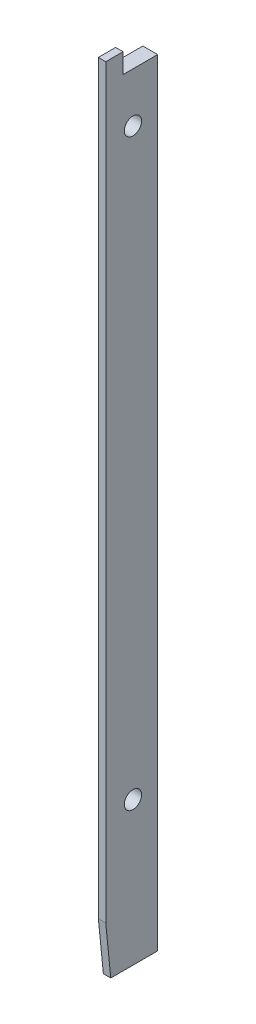
ISO-10303-21;
HEADER;
FILE_DESCRIPTION(('STEP AP214'),'2;1');
FILE_NAME('part.step','',(''),(''),'','','');
FILE_SCHEMA(('AUTOMOTIVE_DESIGN { 1 0 10303 214 1 1 1 1 }'));
ENDSEC;
DATA;
#1=APPLICATION_CONTEXT('core data for automotive mechanical design processes');
#2=APPLICATION_PROTOCOL_DEFINITION('international standard','automotive_design',2000,#1);
#3=PRODUCT_CONTEXT('',#1,'mechanical');
#4=PRODUCT('Part','Part','',(#3));
#5=PRODUCT_RELATED_PRODUCT_CATEGORY('part','',(#4));
#6=PRODUCT_DEFINITION_FORMATION('','',#4);
#7=PRODUCT_DEFINITION_CONTEXT('part definition',#1,'design');
#8=PRODUCT_DEFINITION('design','',#6,#7);
#9=PRODUCT_DEFINITION_SHAPE('','',#8);
#10=(LENGTH_UNIT() NAMED_UNIT(*) SI_UNIT(.MILLI.,.METRE.));
#11=(NAMED_UNIT(*) PLANE_ANGLE_UNIT() SI_UNIT($,.RADIAN.));
#12=(NAMED_UNIT(*) SI_UNIT($,.STERADIAN.) SOLID_ANGLE_UNIT());
#13=UNCERTAINTY_MEASURE_WITH_UNIT(LENGTH_MEASURE(1.E-05),#10,'distance_accuracy_value','');
#14=(GEOMETRIC_REPRESENTATION_CONTEXT(3) GLOBAL_UNCERTAINTY_ASSIGNED_CONTEXT((#13)) GLOBAL_UNIT_ASSIGNED_CONTEXT((#10,
#11,#12)) REPRESENTATION_CONTEXT('',''));
#15=CARTESIAN_POINT('',(0.,0.,0.));
#16=DIRECTION('',(0.,0.,1.));
#17=DIRECTION('',(1.,0.,0.));
#18=AXIS2_PLACEMENT_3D('',#15,#16,#17);
#19=CARTESIAN_POINT('',(0.,157.,0.));
#20=DIRECTION('',(0.,0.,-1.));
#21=DIRECTION('',(-1.,0.,0.));
#22=AXIS2_PLACEMENT_3D('',#19,#20,#21);
#23=PLANE('',#22);
#24=DIRECTION('',(0.,-1.,0.));
#25=VECTOR('',#24,1.);
#26=CARTESIAN_POINT('',(1.49999999999998,161.,0.));
#27=LINE('',#26,#25);
#28=CARTESIAN_POINT('',(1.49999999999999,157.,0.));
#29=VERTEX_POINT('',#28);
#30=CARTESIAN_POINT('',(1.5,0.,0.));
#31=VERTEX_POINT('',#30);
#32=EDGE_CURVE('E42',#29,#31,#27,.T.);
#33=ORIENTED_EDGE('',*,*,#32,.F.);
#34=DIRECTION('',(1.,0.,0.));
#35=VECTOR('',#34,1.);
#36=CARTESIAN_POINT('',(0.,157.,0.));
#37=LINE('',#36,#35);
#38=CARTESIAN_POINT('',(0.,157.,0.));
#39=VERTEX_POINT('',#38);
#40=EDGE_CURVE('E183',#39,#29,#37,.T.);
#41=ORIENTED_EDGE('',*,*,#40,.F.);
#42=DIRECTION('',(0.,-1.,0.));
#43=VECTOR('',#42,1.);
#44=CARTESIAN_POINT('',(0.,157.,0.));
#45=LINE('',#44,#43);
#46=CARTESIAN_POINT('',(0.,0.,0.));
#47=VERTEX_POINT('',#46);
#48=EDGE_CURVE('E133',#39,#47,#45,.T.);
#49=ORIENTED_EDGE('',*,*,#48,.T.);
#50=DIRECTION('',(1.,0.,0.));
#51=VECTOR('',#50,1.);
#52=CARTESIAN_POINT('',(0.,0.,0.));
#53=LINE('',#52,#51);
#54=EDGE_CURVE('E120',#47,#31,#53,.T.);
#55=ORIENTED_EDGE('',*,*,#54,.T.);
#56=EDGE_LOOP('',(#33,#41,#49,#55));
#57=FACE_BOUND('',#56,.T.);
#58=ADVANCED_FACE('F34',(#57),#23,.F.);
#59=CARTESIAN_POINT('',(0.,157.,0.));
#60=DIRECTION('',(1.,0.,0.));
#61=DIRECTION('',(0.,0.,-1.));
#62=AXIS2_PLACEMENT_3D('',#59,#60,#61);
#63=PLANE('',#62);
#64=CARTESIAN_POINT('',(0.,147.,-2.));
#65=DIRECTION('',(1.,0.,0.));
#66=DIRECTION('',(0.,0.,-1.));
#67=AXIS2_PLACEMENT_3D('',#64,#65,#66);
#68=CIRCLE('',#67,1.75);
#69=CARTESIAN_POINT('',(0.,147.,-3.75));
#70=VERTEX_POINT('',#69);
#71=EDGE_CURVE('E144',#70,#70,#68,.T.);
#72=ORIENTED_EDGE('',*,*,#71,.T.);
#73=EDGE_LOOP('',(#72));
#74=FACE_BOUND('',#73,.T.);
#75=CARTESIAN_POINT('',(0.,29.,-2.));
#76=DIRECTION('',(1.,0.,0.));
#77=DIRECTION('',(0.,0.,-1.));
#78=AXIS2_PLACEMENT_3D('',#75,#76,#77);
#79=CIRCLE('',#78,1.75);
#80=CARTESIAN_POINT('',(0.,29.,-3.75));
#81=VERTEX_POINT('',#80);
#82=EDGE_CURVE('E154',#81,#81,#79,.T.);
#83=ORIENTED_EDGE('',*,*,#82,.T.);
#84=EDGE_LOOP('',(#83));
#85=FACE_BOUND('',#84,.T.);
#86=DIRECTION('',(0.,0.,1.));
#87=VECTOR('',#86,1.);
#88=CARTESIAN_POINT('',(0.,0.,0.));
#89=LINE('',#88,#87);
#90=CARTESIAN_POINT('',(0.,0.,-7.));
#91=VERTEX_POINT('',#90);
#92=EDGE_CURVE('E124',#91,#47,#89,.T.);
#93=ORIENTED_EDGE('',*,*,#92,.T.);
#94=ORIENTED_EDGE('',*,*,#48,.F.);
#95=DIRECTION('',(0.,0.,1.));
#96=VECTOR('',#95,1.);
#97=CARTESIAN_POINT('',(0.,157.,0.));
#98=LINE('',#97,#96);
#99=CARTESIAN_POINT('',(0.,157.,-7.));
#100=VERTEX_POINT('',#99);
#101=EDGE_CURVE('E122',#100,#39,#98,.T.);
#102=ORIENTED_EDGE('',*,*,#101,.F.);
#103=DIRECTION('',(0.,-1.,0.));
#104=VECTOR('',#103,1.);
#105=CARTESIAN_POINT('',(0.,157.,-7.));
#106=LINE('',#105,#104);
#107=EDGE_CURVE('E128',#100,#91,#106,.T.);
#108=ORIENTED_EDGE('',*,*,#107,.T.);
#109=EDGE_LOOP('',(#93,#94,#102,#108));
#110=FACE_BOUND('',#109,.T.);
#111=ADVANCED_FACE('F36',(#74,#85,#110),#63,.F.);
#112=CARTESIAN_POINT('',(3.,157.,0.));
#113=DIRECTION('',(-1.,0.,0.));
#114=DIRECTION('',(0.,0.,1.));
#115=AXIS2_PLACEMENT_3D('',#112,#113,#114);
#116=PLANE('',#115);
#117=CARTESIAN_POINT('',(3.,147.,-2.));
#118=DIRECTION('',(1.,0.,0.));
#119=DIRECTION('',(0.,0.,-1.));
#120=AXIS2_PLACEMENT_3D('',#117,#118,#119);
#121=CIRCLE('',#120,1.75);
#122=CARTESIAN_POINT('',(3.,147.,-3.75));
#123=VERTEX_POINT('',#122);
#124=EDGE_CURVE('E149',#123,#123,#121,.T.);
#125=ORIENTED_EDGE('',*,*,#124,.F.);
#126=EDGE_LOOP('',(#125));
#127=FACE_BOUND('',#126,.T.);
#128=CARTESIAN_POINT('',(3.,29.,-2.));
#129=DIRECTION('',(1.,0.,0.));
#130=DIRECTION('',(0.,0.,-1.));
#131=AXIS2_PLACEMENT_3D('',#128,#129,#130);
#132=CIRCLE('',#131,1.75);
#133=CARTESIAN_POINT('',(3.,29.,-3.75));
#134=VERTEX_POINT('',#133);
#135=EDGE_CURVE('E160',#134,#134,#132,.T.);
#136=ORIENTED_EDGE('',*,*,#135,.F.);
#137=EDGE_LOOP('',(#136));
#138=FACE_BOUND('',#137,.T.);
#139=DIRECTION('',(0.,1.,0.));
#140=VECTOR('',#139,1.);
#141=CARTESIAN_POINT('',(2.99999999999998,161.,3.5));
#142=LINE('',#141,#140);
#143=CARTESIAN_POINT('',(3.,10.1493898464408,3.5));
#144=VERTEX_POINT('',#143);
#145=CARTESIAN_POINT('',(2.99999999999998,161.,3.5));
#146=VERTEX_POINT('',#145);
#147=EDGE_CURVE('E114',#144,#146,#142,.T.);
#148=ORIENTED_EDGE('',*,*,#147,.F.);
#149=DIRECTION('',(0.,0.995038220239298,0.0994934181893958));
#150=VECTOR('',#149,1.);
#151=CARTESIAN_POINT('',(3.,0.,2.48516713446816));
#152=LINE('',#151,#150);
#153=CARTESIAN_POINT('',(3.,0.,2.48516713446816));
#154=VERTEX_POINT('',#153);
#155=EDGE_CURVE('E48',#154,#144,#152,.T.);
#156=ORIENTED_EDGE('',*,*,#155,.F.);
#157=DIRECTION('',(0.,0.,-1.));
#158=VECTOR('',#157,1.);
#159=CARTESIAN_POINT('',(3.,0.,0.));
#160=LINE('',#159,#158);
#161=CARTESIAN_POINT('',(3.,0.,-7.));
#162=VERTEX_POINT('',#161);
#163=EDGE_CURVE('E111',#154,#162,#160,.T.);
#164=ORIENTED_EDGE('',*,*,#163,.T.);
#165=DIRECTION('',(0.,-1.,0.));
#166=VECTOR('',#165,1.);
#167=CARTESIAN_POINT('',(3.,157.,-7.));
#168=LINE('',#167,#166);
#169=CARTESIAN_POINT('',(3.,157.,-7.));
#170=VERTEX_POINT('',#169);
#171=EDGE_CURVE('E131',#170,#162,#168,.T.);
#172=ORIENTED_EDGE('',*,*,#171,.F.);
#173=DIRECTION('',(0.,0.,-1.));
#174=VECTOR('',#173,1.);
#175=CARTESIAN_POINT('',(3.,157.,0.));
#176=LINE('',#175,#174);
#177=CARTESIAN_POINT('',(3.,157.,0.));
#178=VERTEX_POINT('',#177);
#179=EDGE_CURVE('E185',#178,#170,#176,.T.);
#180=ORIENTED_EDGE('',*,*,#179,.F.);
#181=DIRECTION('',(0.,1.,0.));
#182=VECTOR('',#181,1.);
#183=CARTESIAN_POINT('',(2.99999999999998,161.,0.));
#184=LINE('',#183,#182);
#185=CARTESIAN_POINT('',(2.99999999999998,161.,0.));
#186=VERTEX_POINT('',#185);
#187=EDGE_CURVE('E143',#178,#186,#184,.T.);
#188=ORIENTED_EDGE('',*,*,#187,.T.);
#189=DIRECTION('',(0.,0.,-1.));
#190=VECTOR('',#189,1.);
#191=CARTESIAN_POINT('',(2.99999999999998,161.,3.5));
#192=LINE('',#191,#190);
#193=EDGE_CURVE('E171',#146,#186,#192,.T.);
#194=ORIENTED_EDGE('',*,*,#193,.F.);
#195=EDGE_LOOP('',(#148,#156,#164,#172,#180,#188,#194));
#196=FACE_BOUND('',#195,.T.);
#197=ADVANCED_FACE('F109',(#127,#138,#196),#116,.F.);
#198=CARTESIAN_POINT('',(0.,157.,-7.));
#199=DIRECTION('',(0.,0.,1.));
#200=DIRECTION('',(1.,0.,0.));
#201=AXIS2_PLACEMENT_3D('',#198,#199,#200);
#202=PLANE('',#201);
#203=DIRECTION('',(-1.,0.,0.));
#204=VECTOR('',#203,1.);
#205=CARTESIAN_POINT('',(0.,0.,-7.));
#206=LINE('',#205,#204);
#207=EDGE_CURVE('E119',#162,#91,#206,.T.);
#208=ORIENTED_EDGE('',*,*,#207,.T.);
#209=ORIENTED_EDGE('',*,*,#107,.F.);
#210=DIRECTION('',(-1.,0.,0.));
#211=VECTOR('',#210,1.);
#212=CARTESIAN_POINT('',(0.,157.,-7.));
#213=LINE('',#212,#211);
#214=EDGE_CURVE('E132',#170,#100,#213,.T.);
#215=ORIENTED_EDGE('',*,*,#214,.F.);
#216=ORIENTED_EDGE('',*,*,#171,.T.);
#217=EDGE_LOOP('',(#208,#209,#215,#216));
#218=FACE_BOUND('',#217,.T.);
#219=ADVANCED_FACE('F197',(#218),#202,.F.);
#220=CARTESIAN_POINT('',(0.,157.,0.));
#221=DIRECTION('',(0.,-1.,0.));
#222=DIRECTION('',(0.,0.,-1.));
#223=AXIS2_PLACEMENT_3D('',#220,#221,#222);
#224=PLANE('',#223);
#225=ORIENTED_EDGE('',*,*,#101,.T.);
#226=ORIENTED_EDGE('',*,*,#40,.T.);
#227=EDGE_CURVE('E182',#29,#178,#37,.T.);
#228=ORIENTED_EDGE('',*,*,#227,.T.);
#229=ORIENTED_EDGE('',*,*,#179,.T.);
#230=ORIENTED_EDGE('',*,*,#214,.T.);
#231=EDGE_LOOP('',(#225,#226,#228,#229,#230));
#232=FACE_BOUND('',#231,.T.);
#233=ADVANCED_FACE('F201',(#232),#224,.F.);
#234=CARTESIAN_POINT('',(0.,0.,0.));
#235=DIRECTION('',(0.,-1.,0.));
#236=DIRECTION('',(0.,0.,-1.));
#237=AXIS2_PLACEMENT_3D('',#234,#235,#236);
#238=PLANE('',#237);
#239=DIRECTION('',(1.,0.,0.));
#240=VECTOR('',#239,1.);
#241=CARTESIAN_POINT('',(0.,0.,2.48516713446816));
#242=LINE('',#241,#240);
#243=CARTESIAN_POINT('',(1.5,0.,2.48516713446816));
#244=VERTEX_POINT('',#243);
#245=EDGE_CURVE('E99',#244,#154,#242,.T.);
#246=ORIENTED_EDGE('',*,*,#245,.F.);
#247=DIRECTION('',(0.,0.,-1.));
#248=VECTOR('',#247,1.);
#249=CARTESIAN_POINT('',(1.5,0.,3.5));
#250=LINE('',#249,#248);
#251=EDGE_CURVE('E175',#244,#31,#250,.T.);
#252=ORIENTED_EDGE('',*,*,#251,.T.);
#253=ORIENTED_EDGE('',*,*,#54,.F.);
#254=ORIENTED_EDGE('',*,*,#92,.F.);
#255=ORIENTED_EDGE('',*,*,#207,.F.);
#256=ORIENTED_EDGE('',*,*,#163,.F.);
#257=EDGE_LOOP('',(#246,#252,#253,#254,#255,#256));
#258=FACE_BOUND('',#257,.T.);
#259=ADVANCED_FACE('F117',(#258),#238,.T.);
#260=CARTESIAN_POINT('',(1.49999999999998,161.,3.5));
#261=DIRECTION('',(1.,0.,0.));
#262=DIRECTION('',(0.,1.,0.));
#263=AXIS2_PLACEMENT_3D('',#260,#261,#262);
#264=PLANE('',#263);
#265=ORIENTED_EDGE('',*,*,#251,.F.);
#266=DIRECTION('',(0.,0.995038220239298,0.0994934181893958));
#267=VECTOR('',#266,1.);
#268=CARTESIAN_POINT('',(1.49999999999998,159.506738821451,18.4341732598538));
#269=LINE('',#268,#267);
#270=CARTESIAN_POINT('',(1.49999999999998,10.1493898464408,3.5));
#271=VERTEX_POINT('',#270);
#272=EDGE_CURVE('E102',#244,#271,#269,.T.);
#273=ORIENTED_EDGE('',*,*,#272,.T.);
#274=DIRECTION('',(0.,-1.,0.));
#275=VECTOR('',#274,1.);
#276=CARTESIAN_POINT('',(1.49999999999998,161.,3.5));
#277=LINE('',#276,#275);
#278=CARTESIAN_POINT('',(1.49999999999998,161.,3.5));
#279=VERTEX_POINT('',#278);
#280=EDGE_CURVE('E163',#279,#271,#277,.T.);
#281=ORIENTED_EDGE('',*,*,#280,.F.);
#282=DIRECTION('',(0.,0.,-1.));
#283=VECTOR('',#282,1.);
#284=CARTESIAN_POINT('',(1.49999999999998,161.,3.5));
#285=LINE('',#284,#283);
#286=CARTESIAN_POINT('',(1.49999999999998,161.,0.));
#287=VERTEX_POINT('',#286);
#288=EDGE_CURVE('E167',#279,#287,#285,.T.);
#289=ORIENTED_EDGE('',*,*,#288,.T.);
#290=EDGE_CURVE('E138',#287,#29,#27,.T.);
#291=ORIENTED_EDGE('',*,*,#290,.T.);
#292=ORIENTED_EDGE('',*,*,#32,.T.);
#293=EDGE_LOOP('',(#265,#273,#281,#289,#291,#292));
#294=FACE_BOUND('',#293,.T.);
#295=ADVANCED_FACE('F205',(#294),#264,.F.);
#296=CARTESIAN_POINT('',(1.49999999999998,161.,3.5));
#297=DIRECTION('',(0.,-1.,0.));
#298=DIRECTION('',(0.,0.,-1.));
#299=AXIS2_PLACEMENT_3D('',#296,#297,#298);
#300=PLANE('',#299);
#301=DIRECTION('',(-1.,0.,0.));
#302=VECTOR('',#301,1.);
#303=CARTESIAN_POINT('',(1.49999999999998,161.,0.));
#304=LINE('',#303,#302);
#305=EDGE_CURVE('E147',#186,#287,#304,.T.);
#306=ORIENTED_EDGE('',*,*,#305,.T.);
#307=ORIENTED_EDGE('',*,*,#288,.F.);
#308=DIRECTION('',(-1.,0.,0.));
#309=VECTOR('',#308,1.);
#310=CARTESIAN_POINT('',(1.49999999999998,161.,3.5));
#311=LINE('',#310,#309);
#312=EDGE_CURVE('E166',#146,#279,#311,.T.);
#313=ORIENTED_EDGE('',*,*,#312,.F.);
#314=ORIENTED_EDGE('',*,*,#193,.T.);
#315=EDGE_LOOP('',(#306,#307,#313,#314));
#316=FACE_BOUND('',#315,.T.);
#317=ADVANCED_FACE('F211',(#316),#300,.F.);
#318=CARTESIAN_POINT('',(0.,0.,3.5));
#319=DIRECTION('',(0.,0.,1.));
#320=DIRECTION('',(1.,0.,0.));
#321=AXIS2_PLACEMENT_3D('',#318,#319,#320);
#322=PLANE('',#321);
#323=DIRECTION('',(-1.,0.,0.));
#324=VECTOR('',#323,1.);
#325=CARTESIAN_POINT('',(0.,10.1493898464408,3.5));
#326=LINE('',#325,#324);
#327=EDGE_CURVE('E11',#144,#271,#326,.T.);
#328=ORIENTED_EDGE('',*,*,#327,.F.);
#329=ORIENTED_EDGE('',*,*,#147,.T.);
#330=ORIENTED_EDGE('',*,*,#312,.T.);
#331=ORIENTED_EDGE('',*,*,#280,.T.);
#332=EDGE_LOOP('',(#328,#329,#330,#331));
#333=FACE_BOUND('',#332,.T.);
#334=ADVANCED_FACE('F214',(#333),#322,.T.);
#335=CARTESIAN_POINT('',(0.,0.,0.));
#336=DIRECTION('',(0.,0.,1.));
#337=DIRECTION('',(1.,0.,0.));
#338=AXIS2_PLACEMENT_3D('',#335,#336,#337);
#339=PLANE('',#338);
#340=ORIENTED_EDGE('',*,*,#227,.F.);
#341=ORIENTED_EDGE('',*,*,#290,.F.);
#342=ORIENTED_EDGE('',*,*,#305,.F.);
#343=ORIENTED_EDGE('',*,*,#187,.F.);
#344=EDGE_LOOP('',(#340,#341,#342,#343));
#345=FACE_BOUND('',#344,.T.);
#346=ADVANCED_FACE('F216',(#345),#339,.F.);
#347=CARTESIAN_POINT('',(0.,29.,-2.));
#348=DIRECTION('',(1.,0.,0.));
#349=DIRECTION('',(0.,0.,-1.));
#350=AXIS2_PLACEMENT_3D('',#347,#348,#349);
#351=CYLINDRICAL_SURFACE('',#350,1.75);
#352=ORIENTED_EDGE('',*,*,#82,.F.);
#353=EDGE_LOOP('',(#352));
#354=FACE_BOUND('',#353,.T.);
#355=ORIENTED_EDGE('',*,*,#135,.T.);
#356=EDGE_LOOP('',(#355));
#357=FACE_BOUND('',#356,.T.);
#358=ADVANCED_FACE('F219',(#354,#357),#351,.F.);
#359=CARTESIAN_POINT('',(0.,147.,-2.));
#360=DIRECTION('',(1.,0.,0.));
#361=DIRECTION('',(0.,0.,-1.));
#362=AXIS2_PLACEMENT_3D('',#359,#360,#361);
#363=CYLINDRICAL_SURFACE('',#362,1.75);
#364=ORIENTED_EDGE('',*,*,#71,.F.);
#365=EDGE_LOOP('',(#364));
#366=FACE_BOUND('',#365,.T.);
#367=ORIENTED_EDGE('',*,*,#124,.T.);
#368=EDGE_LOOP('',(#367));
#369=FACE_BOUND('',#368,.T.);
#370=ADVANCED_FACE('F225',(#366,#369),#363,.F.);
#371=CARTESIAN_POINT('',(0.,0.,2.48516713446816));
#372=DIRECTION('',(0.,0.0994934181893958,-0.995038220239298));
#373=DIRECTION('',(0.,0.995038220239298,0.0994934181893958));
#374=AXIS2_PLACEMENT_3D('',#371,#372,#373);
#375=PLANE('',#374);
#376=ORIENTED_EDGE('',*,*,#245,.T.);
#377=ORIENTED_EDGE('',*,*,#155,.T.);
#378=ORIENTED_EDGE('',*,*,#327,.T.);
#379=ORIENTED_EDGE('',*,*,#272,.F.);
#380=EDGE_LOOP('',(#376,#377,#378,#379));
#381=FACE_BOUND('',#380,.T.);
#382=ADVANCED_FACE('F100',(#381),#375,.F.);
#383=CLOSED_SHELL('',(#58,#111,#197,#219,#233,#259,#295,#317,#334,#346,#358,#370,#382));
#384=MANIFOLD_SOLID_BREP('B2',#383);
#385=ADVANCED_BREP_SHAPE_REPRESENTATION('',(#18,#384),#14);
#386=SHAPE_DEFINITION_REPRESENTATION(#9,#385);
ENDSEC;
END-ISO-10303-21;
